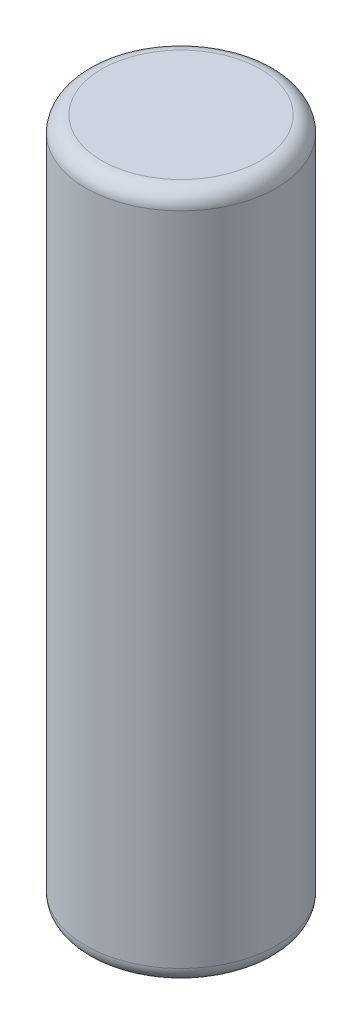
ISO-10303-21;
HEADER;
FILE_DESCRIPTION(('STEP AP214'),'2;1');
FILE_NAME('part.step','',(''),(''),'','','');
FILE_SCHEMA(('AUTOMOTIVE_DESIGN { 1 0 10303 214 1 1 1 1 }'));
ENDSEC;
DATA;
#1=APPLICATION_CONTEXT('core data for automotive mechanical design processes');
#2=APPLICATION_PROTOCOL_DEFINITION('international standard','automotive_design',2000,#1);
#3=PRODUCT_CONTEXT('',#1,'mechanical');
#4=PRODUCT('Part','Part','',(#3));
#5=PRODUCT_RELATED_PRODUCT_CATEGORY('part','',(#4));
#6=PRODUCT_DEFINITION_FORMATION('','',#4);
#7=PRODUCT_DEFINITION_CONTEXT('part definition',#1,'design');
#8=PRODUCT_DEFINITION('design','',#6,#7);
#9=PRODUCT_DEFINITION_SHAPE('','',#8);
#10=(LENGTH_UNIT() NAMED_UNIT(*) SI_UNIT(.MILLI.,.METRE.));
#11=(NAMED_UNIT(*) PLANE_ANGLE_UNIT() SI_UNIT($,.RADIAN.));
#12=(NAMED_UNIT(*) SI_UNIT($,.STERADIAN.) SOLID_ANGLE_UNIT());
#13=UNCERTAINTY_MEASURE_WITH_UNIT(LENGTH_MEASURE(1.E-05),#10,'distance_accuracy_value','');
#14=(GEOMETRIC_REPRESENTATION_CONTEXT(3) GLOBAL_UNCERTAINTY_ASSIGNED_CONTEXT((#13)) GLOBAL_UNIT_ASSIGNED_CONTEXT((#10,
#11,#12)) REPRESENTATION_CONTEXT('',''));
#15=CARTESIAN_POINT('',(0.,0.,0.));
#16=DIRECTION('',(0.,0.,1.));
#17=DIRECTION('',(1.,0.,0.));
#18=AXIS2_PLACEMENT_3D('',#15,#16,#17);
#19=CARTESIAN_POINT('',(0.,65.,0.));
#20=DIRECTION('',(0.,-1.,0.));
#21=DIRECTION('',(0.,0.,-1.));
#22=AXIS2_PLACEMENT_3D('',#19,#20,#21);
#23=CYLINDRICAL_SURFACE('',#22,8.99999999999999);
#24=CARTESIAN_POINT('',(0.,1.5,0.));
#25=DIRECTION('',(0.,1.,0.));
#26=DIRECTION('',(0.,0.,1.));
#27=AXIS2_PLACEMENT_3D('',#24,#25,#26);
#28=CIRCLE('',#27,8.99999999999999);
#29=CARTESIAN_POINT('',(0.,1.5,8.99999999999999));
#30=VERTEX_POINT('',#29);
#31=EDGE_CURVE('E47',#30,#30,#28,.T.);
#32=ORIENTED_EDGE('',*,*,#31,.T.);
#33=EDGE_LOOP('',(#32));
#34=FACE_BOUND('',#33,.T.);
#35=CARTESIAN_POINT('',(0.,63.5,0.));
#36=DIRECTION('',(0.,1.,0.));
#37=DIRECTION('',(0.,0.,1.));
#38=AXIS2_PLACEMENT_3D('',#35,#36,#37);
#39=CIRCLE('',#38,8.99999999999999);
#40=CARTESIAN_POINT('',(0.,63.5,8.99999999999999));
#41=VERTEX_POINT('',#40);
#42=EDGE_CURVE('E51',#41,#41,#39,.F.);
#43=ORIENTED_EDGE('',*,*,#42,.T.);
#44=EDGE_LOOP('',(#43));
#45=FACE_BOUND('',#44,.T.);
#46=ADVANCED_FACE('F36',(#34,#45),#23,.T.);
#47=CARTESIAN_POINT('',(0.,65.,0.));
#48=DIRECTION('',(0.,1.,0.));
#49=DIRECTION('',(0.,0.,1.));
#50=AXIS2_PLACEMENT_3D('',#47,#48,#49);
#51=PLANE('',#50);
#52=CARTESIAN_POINT('',(0.,65.,0.));
#53=DIRECTION('',(0.,1.,0.));
#54=DIRECTION('',(0.,0.,1.));
#55=AXIS2_PLACEMENT_3D('',#52,#53,#54);
#56=CIRCLE('',#55,7.49999999999999);
#57=CARTESIAN_POINT('',(0.,65.,7.49999999999999));
#58=VERTEX_POINT('',#57);
#59=EDGE_CURVE('E10',#58,#58,#56,.T.);
#60=ORIENTED_EDGE('',*,*,#59,.T.);
#61=EDGE_LOOP('',(#60));
#62=FACE_BOUND('',#61,.T.);
#63=ADVANCED_FACE('F67',(#62),#51,.T.);
#64=CARTESIAN_POINT('',(0.,0.,0.));
#65=DIRECTION('',(0.,1.,0.));
#66=DIRECTION('',(0.,0.,1.));
#67=AXIS2_PLACEMENT_3D('',#64,#65,#66);
#68=PLANE('',#67);
#69=CARTESIAN_POINT('',(0.,0.,0.));
#70=DIRECTION('',(0.,1.,0.));
#71=DIRECTION('',(0.,0.,1.));
#72=AXIS2_PLACEMENT_3D('',#69,#70,#71);
#73=CIRCLE('',#72,7.49999999999999);
#74=CARTESIAN_POINT('',(0.,0.,7.49999999999999));
#75=VERTEX_POINT('',#74);
#76=EDGE_CURVE('E43',#75,#75,#73,.F.);
#77=ORIENTED_EDGE('',*,*,#76,.T.);
#78=EDGE_LOOP('',(#77));
#79=FACE_BOUND('',#78,.T.);
#80=ADVANCED_FACE('F64',(#79),#68,.F.);
#81=CARTESIAN_POINT('',(0.,1.5,0.));
#82=DIRECTION('',(0.,1.,0.));
#83=DIRECTION('',(0.,0.,1.));
#84=AXIS2_PLACEMENT_3D('',#81,#82,#83);
#85=TOROIDAL_SURFACE('',#84,7.49999999999999,1.5);
#86=ORIENTED_EDGE('',*,*,#76,.F.);
#87=EDGE_LOOP('',(#86));
#88=FACE_BOUND('',#87,.T.);
#89=ORIENTED_EDGE('',*,*,#31,.F.);
#90=EDGE_LOOP('',(#89));
#91=FACE_BOUND('',#90,.T.);
#92=ADVANCED_FACE('F60',(#88,#91),#85,.T.);
#93=CARTESIAN_POINT('',(0.,63.5,0.));
#94=DIRECTION('',(0.,1.,0.));
#95=DIRECTION('',(0.,0.,1.));
#96=AXIS2_PLACEMENT_3D('',#93,#94,#95);
#97=TOROIDAL_SURFACE('',#96,7.49999999999999,1.5);
#98=ORIENTED_EDGE('',*,*,#42,.F.);
#99=EDGE_LOOP('',(#98));
#100=FACE_BOUND('',#99,.T.);
#101=ORIENTED_EDGE('',*,*,#59,.F.);
#102=EDGE_LOOP('',(#101));
#103=FACE_BOUND('',#102,.T.);
#104=ADVANCED_FACE('F38',(#100,#103),#97,.T.);
#105=CLOSED_SHELL('',(#46,#63,#80,#92,#104));
#106=MANIFOLD_SOLID_BREP('B2',#105);
#107=ADVANCED_BREP_SHAPE_REPRESENTATION('',(#18,#106),#14);
#108=SHAPE_DEFINITION_REPRESENTATION(#9,#107);
ENDSEC;
END-ISO-10303-21;
